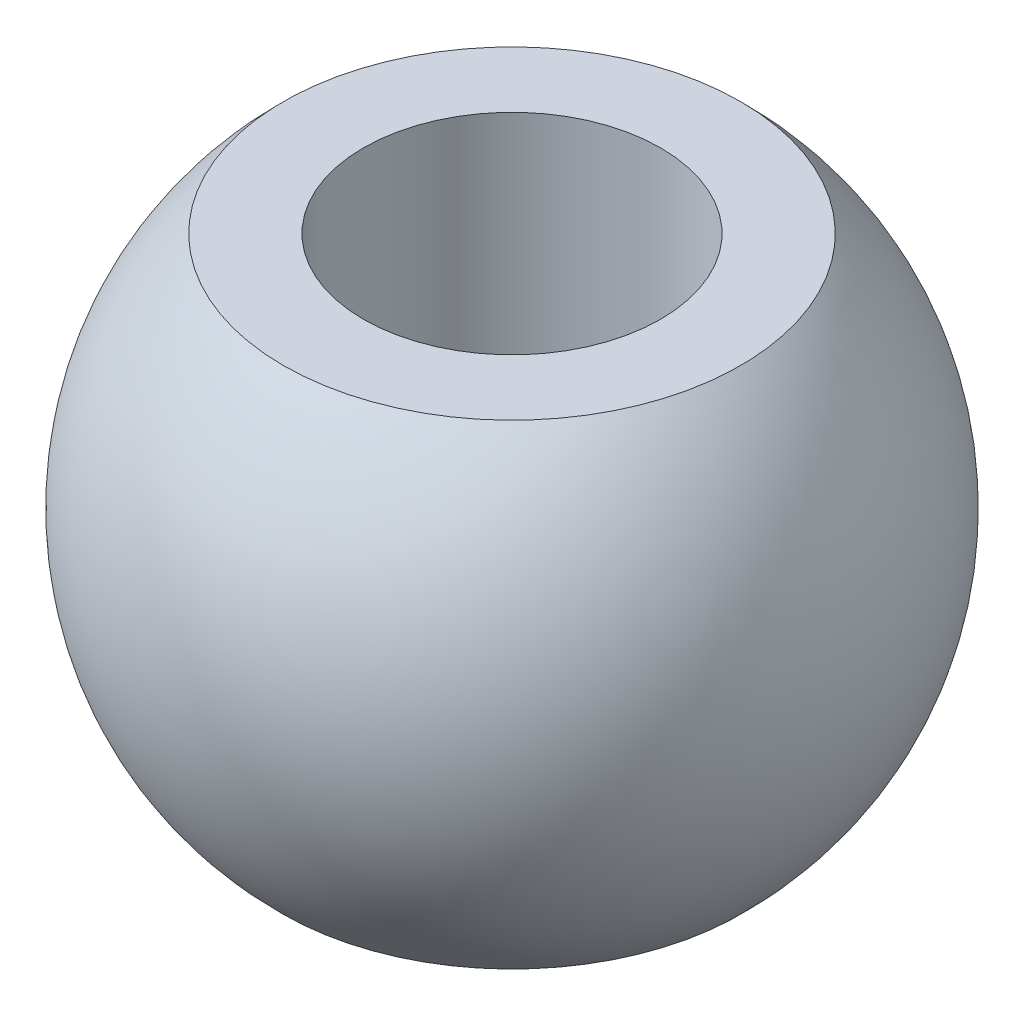
ISO-10303-21;
HEADER;
FILE_DESCRIPTION(('STEP AP214'),'2;1');
FILE_NAME('part.step','',(''),(''),'','','');
FILE_SCHEMA(('AUTOMOTIVE_DESIGN { 1 0 10303 214 1 1 1 1 }'));
ENDSEC;
DATA;
#1=APPLICATION_CONTEXT('core data for automotive mechanical design processes');
#2=APPLICATION_PROTOCOL_DEFINITION('international standard','automotive_design',2000,#1);
#3=PRODUCT_CONTEXT('',#1,'mechanical');
#4=PRODUCT('Part','Part','',(#3));
#5=PRODUCT_RELATED_PRODUCT_CATEGORY('part','',(#4));
#6=PRODUCT_DEFINITION_FORMATION('','',#4);
#7=PRODUCT_DEFINITION_CONTEXT('part definition',#1,'design');
#8=PRODUCT_DEFINITION('design','',#6,#7);
#9=PRODUCT_DEFINITION_SHAPE('','',#8);
#10=(LENGTH_UNIT() NAMED_UNIT(*) SI_UNIT(.MILLI.,.METRE.));
#11=(NAMED_UNIT(*) PLANE_ANGLE_UNIT() SI_UNIT($,.RADIAN.));
#12=(NAMED_UNIT(*) SI_UNIT($,.STERADIAN.) SOLID_ANGLE_UNIT());
#13=UNCERTAINTY_MEASURE_WITH_UNIT(LENGTH_MEASURE(1.E-05),#10,'distance_accuracy_value','');
#14=(GEOMETRIC_REPRESENTATION_CONTEXT(3) GLOBAL_UNCERTAINTY_ASSIGNED_CONTEXT((#13)) GLOBAL_UNIT_ASSIGNED_CONTEXT((#10,
#11,#12)) REPRESENTATION_CONTEXT('',''));
#15=CARTESIAN_POINT('',(0.,0.,0.));
#16=DIRECTION('',(0.,0.,1.));
#17=DIRECTION('',(1.,0.,0.));
#18=AXIS2_PLACEMENT_3D('',#15,#16,#17);
#19=CARTESIAN_POINT('',(2.5,-4.,0.));
#20=DIRECTION('',(0.,-1.,0.));
#21=DIRECTION('',(0.,0.,-1.));
#22=AXIS2_PLACEMENT_3D('',#19,#20,#21);
#23=PLANE('',#22);
#24=CARTESIAN_POINT('',(0.,-4.,0.));
#25=DIRECTION('',(0.,-1.,0.));
#26=DIRECTION('',(0.,0.,-1.));
#27=AXIS2_PLACEMENT_3D('',#24,#25,#26);
#28=CIRCLE('',#27,3.84740172064213);
#29=CARTESIAN_POINT('',(0.,-4.,-3.84740172064213));
#30=VERTEX_POINT('',#29);
#31=EDGE_CURVE('E10',#30,#30,#28,.T.);
#32=ORIENTED_EDGE('',*,*,#31,.T.);
#33=EDGE_LOOP('',(#32));
#34=FACE_BOUND('',#33,.T.);
#35=CARTESIAN_POINT('',(0.,-4.,0.));
#36=DIRECTION('',(0.,-1.,0.));
#37=DIRECTION('',(0.,0.,-1.));
#38=AXIS2_PLACEMENT_3D('',#35,#36,#37);
#39=CIRCLE('',#38,2.5);
#40=CARTESIAN_POINT('',(0.,-4.,-2.5));
#41=VERTEX_POINT('',#40);
#42=EDGE_CURVE('E45',#41,#41,#39,.T.);
#43=ORIENTED_EDGE('',*,*,#42,.F.);
#44=EDGE_LOOP('',(#43));
#45=FACE_BOUND('',#44,.T.);
#46=ADVANCED_FACE('F31',(#34,#45),#23,.T.);
#47=CARTESIAN_POINT('',(0.,0.,0.));
#48=DIRECTION('',(0.,-1.,0.));
#49=DIRECTION('',(1.,0.,0.));
#50=AXIS2_PLACEMENT_3D('',#47,#48,#49);
#51=SPHERICAL_SURFACE('',#50,5.55);
#52=CARTESIAN_POINT('',(0.,4.,0.));
#53=DIRECTION('',(0.,-1.,0.));
#54=DIRECTION('',(0.,0.,-1.));
#55=AXIS2_PLACEMENT_3D('',#52,#53,#54);
#56=CIRCLE('',#55,3.84740172064213);
#57=CARTESIAN_POINT('',(0.,4.,-3.84740172064213));
#58=VERTEX_POINT('',#57);
#59=EDGE_CURVE('E37',#58,#58,#56,.T.);
#60=ORIENTED_EDGE('',*,*,#59,.T.);
#61=EDGE_LOOP('',(#60));
#62=FACE_BOUND('',#61,.T.);
#63=ORIENTED_EDGE('',*,*,#31,.F.);
#64=EDGE_LOOP('',(#63));
#65=FACE_BOUND('',#64,.T.);
#66=ADVANCED_FACE('F55',(#62,#65),#51,.T.);
#67=CARTESIAN_POINT('',(2.5,4.,0.));
#68=DIRECTION('',(0.,1.,0.));
#69=DIRECTION('',(0.,0.,1.));
#70=AXIS2_PLACEMENT_3D('',#67,#68,#69);
#71=PLANE('',#70);
#72=CARTESIAN_POINT('',(0.,4.,0.));
#73=DIRECTION('',(0.,-1.,0.));
#74=DIRECTION('',(0.,0.,-1.));
#75=AXIS2_PLACEMENT_3D('',#72,#73,#74);
#76=CIRCLE('',#75,2.5);
#77=CARTESIAN_POINT('',(0.,4.,-2.5));
#78=VERTEX_POINT('',#77);
#79=EDGE_CURVE('E41',#78,#78,#76,.T.);
#80=ORIENTED_EDGE('',*,*,#79,.T.);
#81=EDGE_LOOP('',(#80));
#82=FACE_BOUND('',#81,.T.);
#83=ORIENTED_EDGE('',*,*,#59,.F.);
#84=EDGE_LOOP('',(#83));
#85=FACE_BOUND('',#84,.T.);
#86=ADVANCED_FACE('F59',(#82,#85),#71,.T.);
#87=CARTESIAN_POINT('',(0.,-11.1,0.));
#88=DIRECTION('',(0.,-1.,0.));
#89=DIRECTION('',(0.,0.,-1.));
#90=AXIS2_PLACEMENT_3D('',#87,#88,#89);
#91=CYLINDRICAL_SURFACE('',#90,2.5);
#92=ORIENTED_EDGE('',*,*,#42,.T.);
#93=EDGE_LOOP('',(#92));
#94=FACE_BOUND('',#93,.T.);
#95=ORIENTED_EDGE('',*,*,#79,.F.);
#96=EDGE_LOOP('',(#95));
#97=FACE_BOUND('',#96,.T.);
#98=ADVANCED_FACE('F51',(#94,#97),#91,.F.);
#99=CLOSED_SHELL('',(#46,#66,#86,#98));
#100=MANIFOLD_SOLID_BREP('B2',#99);
#101=ADVANCED_BREP_SHAPE_REPRESENTATION('',(#18,#100),#14);
#102=SHAPE_DEFINITION_REPRESENTATION(#9,#101);
ENDSEC;
END-ISO-10303-21;
